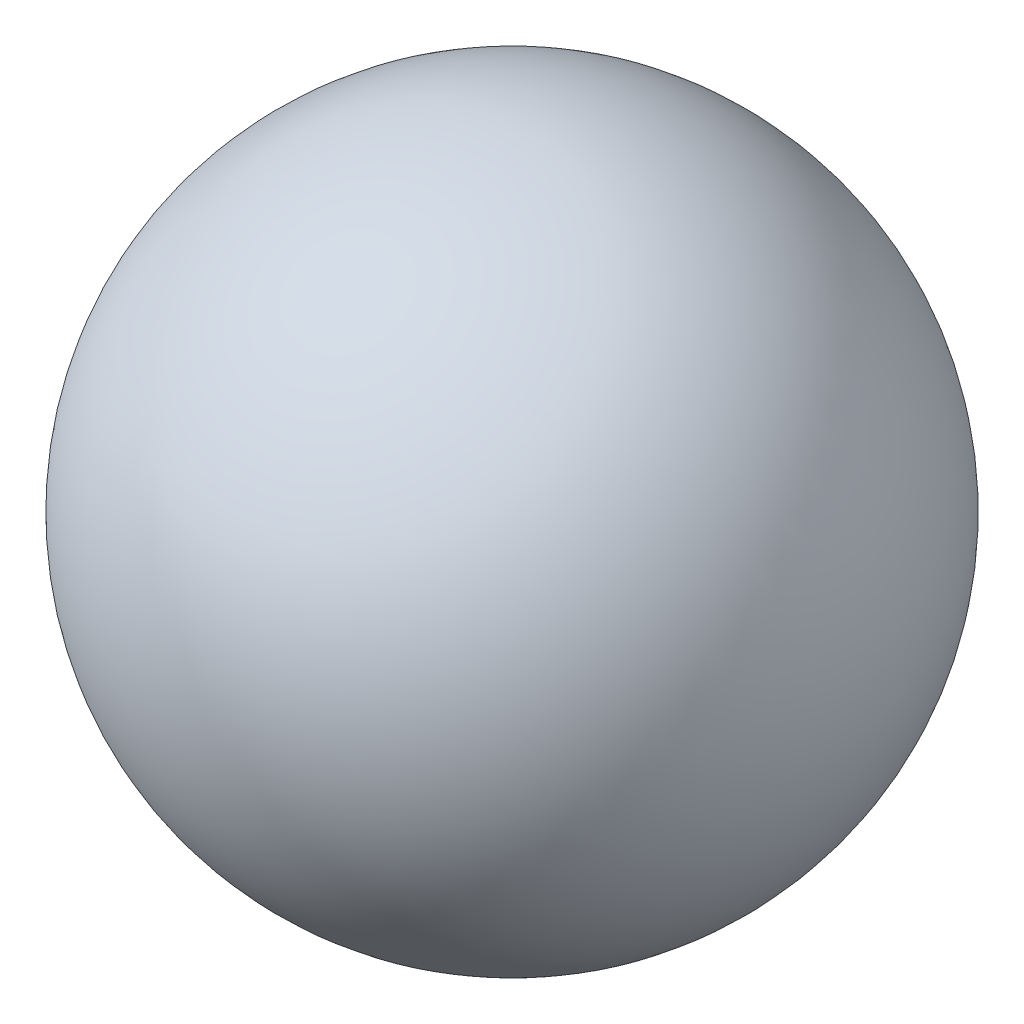
ISO-10303-21;
HEADER;
FILE_DESCRIPTION(('STEP AP214'),'2;1');
FILE_NAME('part.step','',(''),(''),'','','');
FILE_SCHEMA(('AUTOMOTIVE_DESIGN { 1 0 10303 214 1 1 1 1 }'));
ENDSEC;
DATA;
#1=APPLICATION_CONTEXT('core data for automotive mechanical design processes');
#2=APPLICATION_PROTOCOL_DEFINITION('international standard','automotive_design',2000,#1);
#3=PRODUCT_CONTEXT('',#1,'mechanical');
#4=PRODUCT('Part','Part','',(#3));
#5=PRODUCT_RELATED_PRODUCT_CATEGORY('part','',(#4));
#6=PRODUCT_DEFINITION_FORMATION('','',#4);
#7=PRODUCT_DEFINITION_CONTEXT('part definition',#1,'design');
#8=PRODUCT_DEFINITION('design','',#6,#7);
#9=PRODUCT_DEFINITION_SHAPE('','',#8);
#10=(LENGTH_UNIT() NAMED_UNIT(*) SI_UNIT(.MILLI.,.METRE.));
#11=(NAMED_UNIT(*) PLANE_ANGLE_UNIT() SI_UNIT($,.RADIAN.));
#12=(NAMED_UNIT(*) SI_UNIT($,.STERADIAN.) SOLID_ANGLE_UNIT());
#13=UNCERTAINTY_MEASURE_WITH_UNIT(LENGTH_MEASURE(1.E-05),#10,'distance_accuracy_value','');
#14=(GEOMETRIC_REPRESENTATION_CONTEXT(3) GLOBAL_UNCERTAINTY_ASSIGNED_CONTEXT((#13)) GLOBAL_UNIT_ASSIGNED_CONTEXT((#10,
#11,#12)) REPRESENTATION_CONTEXT('',''));
#15=CARTESIAN_POINT('',(0.,0.,0.));
#16=DIRECTION('',(0.,0.,1.));
#17=DIRECTION('',(1.,0.,0.));
#18=AXIS2_PLACEMENT_3D('',#15,#16,#17);
#19=CARTESIAN_POINT('',(0.,0.,0.));
#20=DIRECTION('',(0.,1.,0.));
#21=DIRECTION('',(1.,0.,0.));
#22=AXIS2_PLACEMENT_3D('',#19,#20,#21);
#23=SPHERICAL_SURFACE('',#22,1.25);
#24=CARTESIAN_POINT('',(0.,1.25,0.));
#25=VERTEX_POINT('',#24);
#26=VERTEX_LOOP('',#25);
#27=FACE_BOUND('',#26,.T.);
#28=ADVANCED_FACE('F31',(#27),#23,.T.);
#29=CLOSED_SHELL('',(#28));
#30=MANIFOLD_SOLID_BREP('B2',#29);
#31=ADVANCED_BREP_SHAPE_REPRESENTATION('',(#18,#30),#14);
#32=SHAPE_DEFINITION_REPRESENTATION(#9,#31);
ENDSEC;
END-ISO-10303-21;
